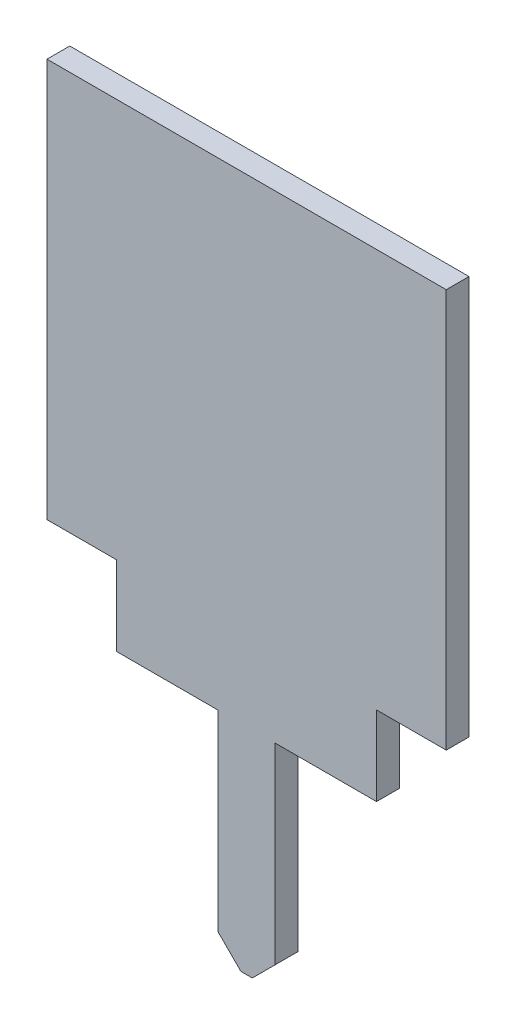
ISO-10303-21;
HEADER;
FILE_DESCRIPTION(('STEP AP214'),'2;1');
FILE_NAME('part.step','',(''),(''),'','','');
FILE_SCHEMA(('AUTOMOTIVE_DESIGN { 1 0 10303 214 1 1 1 1 }'));
ENDSEC;
DATA;
#1=APPLICATION_CONTEXT('core data for automotive mechanical design processes');
#2=APPLICATION_PROTOCOL_DEFINITION('international standard','automotive_design',2000,#1);
#3=PRODUCT_CONTEXT('',#1,'mechanical');
#4=PRODUCT('Part','Part','',(#3));
#5=PRODUCT_RELATED_PRODUCT_CATEGORY('part','',(#4));
#6=PRODUCT_DEFINITION_FORMATION('','',#4);
#7=PRODUCT_DEFINITION_CONTEXT('part definition',#1,'design');
#8=PRODUCT_DEFINITION('design','',#6,#7);
#9=PRODUCT_DEFINITION_SHAPE('','',#8);
#10=(LENGTH_UNIT() NAMED_UNIT(*) SI_UNIT(.MILLI.,.METRE.));
#11=(NAMED_UNIT(*) PLANE_ANGLE_UNIT() SI_UNIT($,.RADIAN.));
#12=(NAMED_UNIT(*) SI_UNIT($,.STERADIAN.) SOLID_ANGLE_UNIT());
#13=UNCERTAINTY_MEASURE_WITH_UNIT(LENGTH_MEASURE(1.E-05),#10,'distance_accuracy_value','');
#14=(GEOMETRIC_REPRESENTATION_CONTEXT(3) GLOBAL_UNCERTAINTY_ASSIGNED_CONTEXT((#13)) GLOBAL_UNIT_ASSIGNED_CONTEXT((#10,
#11,#12)) REPRESENTATION_CONTEXT('',''));
#15=CARTESIAN_POINT('',(0.,0.,0.));
#16=DIRECTION('',(0.,0.,1.));
#17=DIRECTION('',(1.,0.,0.));
#18=AXIS2_PLACEMENT_3D('',#15,#16,#17);
#19=CARTESIAN_POINT('',(2.225,0.,0.127));
#20=DIRECTION('',(0.,-1.,0.));
#21=DIRECTION('',(0.,0.,-1.));
#22=AXIS2_PLACEMENT_3D('',#19,#20,#21);
#23=PLANE('',#22);
#24=DIRECTION('',(-1.,0.,0.));
#25=VECTOR('',#24,1.);
#26=CARTESIAN_POINT('',(2.225,0.,-0.127));
#27=LINE('',#26,#25);
#28=CARTESIAN_POINT('',(2.225,0.,-0.127));
#29=VERTEX_POINT('',#28);
#30=CARTESIAN_POINT('',(-2.225,0.,-0.127));
#31=VERTEX_POINT('',#30);
#32=EDGE_CURVE('E11',#29,#31,#27,.T.);
#33=ORIENTED_EDGE('',*,*,#32,.T.);
#34=DIRECTION('',(0.,0.,-1.));
#35=VECTOR('',#34,1.);
#36=CARTESIAN_POINT('',(-2.225,0.,0.127));
#37=LINE('',#36,#35);
#38=CARTESIAN_POINT('',(-2.225,0.,0.127));
#39=VERTEX_POINT('',#38);
#40=EDGE_CURVE('E25',#39,#31,#37,.T.);
#41=ORIENTED_EDGE('',*,*,#40,.F.);
#42=DIRECTION('',(-1.,0.,0.));
#43=VECTOR('',#42,1.);
#44=CARTESIAN_POINT('',(2.225,0.,0.127));
#45=LINE('',#44,#43);
#46=CARTESIAN_POINT('',(2.225,0.,0.127));
#47=VERTEX_POINT('',#46);
#48=EDGE_CURVE('E296',#47,#39,#45,.T.);
#49=ORIENTED_EDGE('',*,*,#48,.F.);
#50=DIRECTION('',(0.,0.,-1.));
#51=VECTOR('',#50,1.);
#52=CARTESIAN_POINT('',(2.225,0.,0.127));
#53=LINE('',#52,#51);
#54=EDGE_CURVE('E292',#47,#29,#53,.T.);
#55=ORIENTED_EDGE('',*,*,#54,.T.);
#56=EDGE_LOOP('',(#33,#41,#49,#55));
#57=FACE_BOUND('',#56,.T.);
#58=ADVANCED_FACE('F17',(#57),#23,.F.);
#59=CARTESIAN_POINT('',(2.225,-4.445,0.127));
#60=DIRECTION('',(-1.,0.,0.));
#61=DIRECTION('',(0.,0.,1.));
#62=AXIS2_PLACEMENT_3D('',#59,#60,#61);
#63=PLANE('',#62);
#64=DIRECTION('',(0.,1.,0.));
#65=VECTOR('',#64,1.);
#66=CARTESIAN_POINT('',(2.225,-4.445,-0.127));
#67=LINE('',#66,#65);
#68=CARTESIAN_POINT('',(2.225,-4.445,-0.127));
#69=VERTEX_POINT('',#68);
#70=EDGE_CURVE('E287',#69,#29,#67,.T.);
#71=ORIENTED_EDGE('',*,*,#70,.T.);
#72=ORIENTED_EDGE('',*,*,#54,.F.);
#73=DIRECTION('',(0.,1.,0.));
#74=VECTOR('',#73,1.);
#75=CARTESIAN_POINT('',(2.225,-4.445,0.127));
#76=LINE('',#75,#74);
#77=CARTESIAN_POINT('',(2.225,-4.445,0.127));
#78=VERTEX_POINT('',#77);
#79=EDGE_CURVE('E282',#78,#47,#76,.T.);
#80=ORIENTED_EDGE('',*,*,#79,.F.);
#81=DIRECTION('',(0.,0.,-1.));
#82=VECTOR('',#81,1.);
#83=CARTESIAN_POINT('',(2.225,-4.445,0.127));
#84=LINE('',#83,#82);
#85=EDGE_CURVE('E278',#78,#69,#84,.T.);
#86=ORIENTED_EDGE('',*,*,#85,.T.);
#87=EDGE_LOOP('',(#71,#72,#80,#86));
#88=FACE_BOUND('',#87,.T.);
#89=ADVANCED_FACE('F309',(#88),#63,.F.);
#90=CARTESIAN_POINT('',(1.448,-4.445,0.127));
#91=DIRECTION('',(0.,1.,0.));
#92=DIRECTION('',(0.,0.,1.));
#93=AXIS2_PLACEMENT_3D('',#90,#91,#92);
#94=PLANE('',#93);
#95=DIRECTION('',(1.,0.,0.));
#96=VECTOR('',#95,1.);
#97=CARTESIAN_POINT('',(1.448,-4.445,-0.127));
#98=LINE('',#97,#96);
#99=CARTESIAN_POINT('',(1.448,-4.445,-0.127));
#100=VERTEX_POINT('',#99);
#101=EDGE_CURVE('E273',#100,#69,#98,.T.);
#102=ORIENTED_EDGE('',*,*,#101,.T.);
#103=ORIENTED_EDGE('',*,*,#85,.F.);
#104=DIRECTION('',(1.,0.,0.));
#105=VECTOR('',#104,1.);
#106=CARTESIAN_POINT('',(1.448,-4.445,0.127));
#107=LINE('',#106,#105);
#108=CARTESIAN_POINT('',(1.448,-4.445,0.127));
#109=VERTEX_POINT('',#108);
#110=EDGE_CURVE('E268',#109,#78,#107,.T.);
#111=ORIENTED_EDGE('',*,*,#110,.F.);
#112=DIRECTION('',(0.,0.,-1.));
#113=VECTOR('',#112,1.);
#114=CARTESIAN_POINT('',(1.448,-4.445,0.127));
#115=LINE('',#114,#113);
#116=EDGE_CURVE('E264',#109,#100,#115,.T.);
#117=ORIENTED_EDGE('',*,*,#116,.T.);
#118=EDGE_LOOP('',(#102,#103,#111,#117));
#119=FACE_BOUND('',#118,.T.);
#120=ADVANCED_FACE('F316',(#119),#94,.F.);
#121=CARTESIAN_POINT('',(1.448,-5.33,0.127));
#122=DIRECTION('',(-1.,0.,0.));
#123=DIRECTION('',(0.,0.,1.));
#124=AXIS2_PLACEMENT_3D('',#121,#122,#123);
#125=PLANE('',#124);
#126=DIRECTION('',(0.,1.,0.));
#127=VECTOR('',#126,1.);
#128=CARTESIAN_POINT('',(1.448,-5.33,-0.127));
#129=LINE('',#128,#127);
#130=CARTESIAN_POINT('',(1.448,-5.33,-0.127));
#131=VERTEX_POINT('',#130);
#132=EDGE_CURVE('E259',#131,#100,#129,.T.);
#133=ORIENTED_EDGE('',*,*,#132,.T.);
#134=ORIENTED_EDGE('',*,*,#116,.F.);
#135=DIRECTION('',(0.,1.,0.));
#136=VECTOR('',#135,1.);
#137=CARTESIAN_POINT('',(1.448,-5.33,0.127));
#138=LINE('',#137,#136);
#139=CARTESIAN_POINT('',(1.448,-5.33,0.127));
#140=VERTEX_POINT('',#139);
#141=EDGE_CURVE('E254',#140,#109,#138,.T.);
#142=ORIENTED_EDGE('',*,*,#141,.F.);
#143=DIRECTION('',(0.,0.,-1.));
#144=VECTOR('',#143,1.);
#145=CARTESIAN_POINT('',(1.448,-5.33,0.127));
#146=LINE('',#145,#144);
#147=EDGE_CURVE('E250',#140,#131,#146,.T.);
#148=ORIENTED_EDGE('',*,*,#147,.T.);
#149=EDGE_LOOP('',(#133,#134,#142,#148));
#150=FACE_BOUND('',#149,.T.);
#151=ADVANCED_FACE('F319',(#150),#125,.F.);
#152=CARTESIAN_POINT('',(0.3175,-5.33,0.127));
#153=DIRECTION('',(0.,1.,0.));
#154=DIRECTION('',(0.,0.,1.));
#155=AXIS2_PLACEMENT_3D('',#152,#153,#154);
#156=PLANE('',#155);
#157=DIRECTION('',(1.,0.,0.));
#158=VECTOR('',#157,1.);
#159=CARTESIAN_POINT('',(0.3175,-5.33,-0.127));
#160=LINE('',#159,#158);
#161=CARTESIAN_POINT('',(0.3175,-5.33,-0.127));
#162=VERTEX_POINT('',#161);
#163=EDGE_CURVE('E245',#162,#131,#160,.T.);
#164=ORIENTED_EDGE('',*,*,#163,.T.);
#165=ORIENTED_EDGE('',*,*,#147,.F.);
#166=DIRECTION('',(1.,0.,0.));
#167=VECTOR('',#166,1.);
#168=CARTESIAN_POINT('',(0.3175,-5.33,0.127));
#169=LINE('',#168,#167);
#170=CARTESIAN_POINT('',(0.3175,-5.33,0.127));
#171=VERTEX_POINT('',#170);
#172=EDGE_CURVE('E240',#171,#140,#169,.T.);
#173=ORIENTED_EDGE('',*,*,#172,.F.);
#174=DIRECTION('',(0.,0.,-1.));
#175=VECTOR('',#174,1.);
#176=CARTESIAN_POINT('',(0.3175,-5.33,0.127));
#177=LINE('',#176,#175);
#178=EDGE_CURVE('E236',#171,#162,#177,.T.);
#179=ORIENTED_EDGE('',*,*,#178,.T.);
#180=EDGE_LOOP('',(#164,#165,#173,#179));
#181=FACE_BOUND('',#180,.T.);
#182=ADVANCED_FACE('F322',(#181),#156,.F.);
#183=CARTESIAN_POINT('',(0.3175,-7.471,0.127));
#184=DIRECTION('',(-1.,0.,0.));
#185=DIRECTION('',(0.,0.,1.));
#186=AXIS2_PLACEMENT_3D('',#183,#184,#185);
#187=PLANE('',#186);
#188=DIRECTION('',(0.,1.,0.));
#189=VECTOR('',#188,1.);
#190=CARTESIAN_POINT('',(0.3175,-7.471,-0.127));
#191=LINE('',#190,#189);
#192=CARTESIAN_POINT('',(0.3175,-7.471,-0.127));
#193=VERTEX_POINT('',#192);
#194=EDGE_CURVE('E231',#193,#162,#191,.T.);
#195=ORIENTED_EDGE('',*,*,#194,.T.);
#196=ORIENTED_EDGE('',*,*,#178,.F.);
#197=DIRECTION('',(0.,1.,0.));
#198=VECTOR('',#197,1.);
#199=CARTESIAN_POINT('',(0.3175,-7.471,0.127));
#200=LINE('',#199,#198);
#201=CARTESIAN_POINT('',(0.3175,-7.471,0.127));
#202=VERTEX_POINT('',#201);
#203=EDGE_CURVE('E226',#202,#171,#200,.T.);
#204=ORIENTED_EDGE('',*,*,#203,.F.);
#205=DIRECTION('',(0.,0.,-1.));
#206=VECTOR('',#205,1.);
#207=CARTESIAN_POINT('',(0.3175,-7.471,0.127));
#208=LINE('',#207,#206);
#209=EDGE_CURVE('E222',#202,#193,#208,.T.);
#210=ORIENTED_EDGE('',*,*,#209,.T.);
#211=EDGE_LOOP('',(#195,#196,#204,#210));
#212=FACE_BOUND('',#211,.T.);
#213=ADVANCED_FACE('F328',(#212),#187,.F.);
#214=CARTESIAN_POINT('',(0.0635,-7.725,0.127));
#215=DIRECTION('',(-0.707106781186547,0.707106781186548,0.));
#216=DIRECTION('',(-0.707106781186548,-0.707106781186547,0.));
#217=AXIS2_PLACEMENT_3D('',#214,#215,#216);
#218=PLANE('',#217);
#219=DIRECTION('',(0.707106781186548,0.707106781186547,0.));
#220=VECTOR('',#219,1.);
#221=CARTESIAN_POINT('',(0.0635,-7.725,-0.127));
#222=LINE('',#221,#220);
#223=CARTESIAN_POINT('',(0.0635,-7.725,-0.127));
#224=VERTEX_POINT('',#223);
#225=EDGE_CURVE('E217',#224,#193,#222,.T.);
#226=ORIENTED_EDGE('',*,*,#225,.T.);
#227=ORIENTED_EDGE('',*,*,#209,.F.);
#228=DIRECTION('',(0.707106781186548,0.707106781186547,0.));
#229=VECTOR('',#228,1.);
#230=CARTESIAN_POINT('',(0.0635,-7.725,0.127));
#231=LINE('',#230,#229);
#232=CARTESIAN_POINT('',(0.0635,-7.725,0.127));
#233=VERTEX_POINT('',#232);
#234=EDGE_CURVE('E212',#233,#202,#231,.T.);
#235=ORIENTED_EDGE('',*,*,#234,.F.);
#236=DIRECTION('',(0.,0.,-1.));
#237=VECTOR('',#236,1.);
#238=CARTESIAN_POINT('',(0.0635,-7.725,0.127));
#239=LINE('',#238,#237);
#240=EDGE_CURVE('E208',#233,#224,#239,.T.);
#241=ORIENTED_EDGE('',*,*,#240,.T.);
#242=EDGE_LOOP('',(#226,#227,#235,#241));
#243=FACE_BOUND('',#242,.T.);
#244=ADVANCED_FACE('F331',(#243),#218,.F.);
#245=CARTESIAN_POINT('',(-0.0635,-7.725,0.127));
#246=DIRECTION('',(0.,1.,0.));
#247=DIRECTION('',(0.,0.,1.));
#248=AXIS2_PLACEMENT_3D('',#245,#246,#247);
#249=PLANE('',#248);
#250=DIRECTION('',(1.,0.,0.));
#251=VECTOR('',#250,1.);
#252=CARTESIAN_POINT('',(-0.0635,-7.725,-0.127));
#253=LINE('',#252,#251);
#254=CARTESIAN_POINT('',(-0.0635,-7.725,-0.127));
#255=VERTEX_POINT('',#254);
#256=EDGE_CURVE('E203',#255,#224,#253,.T.);
#257=ORIENTED_EDGE('',*,*,#256,.T.);
#258=ORIENTED_EDGE('',*,*,#240,.F.);
#259=DIRECTION('',(1.,0.,0.));
#260=VECTOR('',#259,1.);
#261=CARTESIAN_POINT('',(-0.0635,-7.725,0.127));
#262=LINE('',#261,#260);
#263=CARTESIAN_POINT('',(-0.0635,-7.725,0.127));
#264=VERTEX_POINT('',#263);
#265=EDGE_CURVE('E198',#264,#233,#262,.T.);
#266=ORIENTED_EDGE('',*,*,#265,.F.);
#267=DIRECTION('',(0.,0.,-1.));
#268=VECTOR('',#267,1.);
#269=CARTESIAN_POINT('',(-0.0635,-7.725,0.127));
#270=LINE('',#269,#268);
#271=EDGE_CURVE('E194',#264,#255,#270,.T.);
#272=ORIENTED_EDGE('',*,*,#271,.T.);
#273=EDGE_LOOP('',(#257,#258,#266,#272));
#274=FACE_BOUND('',#273,.T.);
#275=ADVANCED_FACE('F334',(#274),#249,.F.);
#276=CARTESIAN_POINT('',(-0.3175,-7.471,0.127));
#277=DIRECTION('',(0.707106781186547,0.707106781186548,0.));
#278=DIRECTION('',(-0.707106781186548,0.707106781186547,0.));
#279=AXIS2_PLACEMENT_3D('',#276,#277,#278);
#280=PLANE('',#279);
#281=DIRECTION('',(0.707106781186548,-0.707106781186547,0.));
#282=VECTOR('',#281,1.);
#283=CARTESIAN_POINT('',(-0.3175,-7.471,-0.127));
#284=LINE('',#283,#282);
#285=CARTESIAN_POINT('',(-0.3175,-7.471,-0.127));
#286=VERTEX_POINT('',#285);
#287=EDGE_CURVE('E189',#286,#255,#284,.T.);
#288=ORIENTED_EDGE('',*,*,#287,.T.);
#289=ORIENTED_EDGE('',*,*,#271,.F.);
#290=DIRECTION('',(0.707106781186548,-0.707106781186547,0.));
#291=VECTOR('',#290,1.);
#292=CARTESIAN_POINT('',(-0.3175,-7.471,0.127));
#293=LINE('',#292,#291);
#294=CARTESIAN_POINT('',(-0.3175,-7.471,0.127));
#295=VERTEX_POINT('',#294);
#296=EDGE_CURVE('E184',#295,#264,#293,.T.);
#297=ORIENTED_EDGE('',*,*,#296,.F.);
#298=DIRECTION('',(0.,0.,-1.));
#299=VECTOR('',#298,1.);
#300=CARTESIAN_POINT('',(-0.3175,-7.471,0.127));
#301=LINE('',#300,#299);
#302=EDGE_CURVE('E180',#295,#286,#301,.T.);
#303=ORIENTED_EDGE('',*,*,#302,.T.);
#304=EDGE_LOOP('',(#288,#289,#297,#303));
#305=FACE_BOUND('',#304,.T.);
#306=ADVANCED_FACE('F339',(#305),#280,.F.);
#307=CARTESIAN_POINT('',(-0.3175,-5.33,0.127));
#308=DIRECTION('',(1.,0.,0.));
#309=DIRECTION('',(0.,0.,-1.));
#310=AXIS2_PLACEMENT_3D('',#307,#308,#309);
#311=PLANE('',#310);
#312=DIRECTION('',(0.,-1.,0.));
#313=VECTOR('',#312,1.);
#314=CARTESIAN_POINT('',(-0.3175,-5.33,-0.127));
#315=LINE('',#314,#313);
#316=CARTESIAN_POINT('',(-0.3175,-5.33,-0.127));
#317=VERTEX_POINT('',#316);
#318=EDGE_CURVE('E175',#317,#286,#315,.T.);
#319=ORIENTED_EDGE('',*,*,#318,.T.);
#320=ORIENTED_EDGE('',*,*,#302,.F.);
#321=DIRECTION('',(0.,-1.,0.));
#322=VECTOR('',#321,1.);
#323=CARTESIAN_POINT('',(-0.3175,-5.33,0.127));
#324=LINE('',#323,#322);
#325=CARTESIAN_POINT('',(-0.3175,-5.33,0.127));
#326=VERTEX_POINT('',#325);
#327=EDGE_CURVE('E170',#326,#295,#324,.T.);
#328=ORIENTED_EDGE('',*,*,#327,.F.);
#329=DIRECTION('',(0.,0.,-1.));
#330=VECTOR('',#329,1.);
#331=CARTESIAN_POINT('',(-0.3175,-5.33,0.127));
#332=LINE('',#331,#330);
#333=EDGE_CURVE('E166',#326,#317,#332,.T.);
#334=ORIENTED_EDGE('',*,*,#333,.T.);
#335=EDGE_LOOP('',(#319,#320,#328,#334));
#336=FACE_BOUND('',#335,.T.);
#337=ADVANCED_FACE('F342',(#336),#311,.F.);
#338=CARTESIAN_POINT('',(-1.448,-5.33,0.127));
#339=DIRECTION('',(0.,1.,0.));
#340=DIRECTION('',(0.,0.,1.));
#341=AXIS2_PLACEMENT_3D('',#338,#339,#340);
#342=PLANE('',#341);
#343=DIRECTION('',(1.,0.,0.));
#344=VECTOR('',#343,1.);
#345=CARTESIAN_POINT('',(-1.448,-5.33,-0.127));
#346=LINE('',#345,#344);
#347=CARTESIAN_POINT('',(-1.448,-5.33,-0.127));
#348=VERTEX_POINT('',#347);
#349=EDGE_CURVE('E161',#348,#317,#346,.T.);
#350=ORIENTED_EDGE('',*,*,#349,.T.);
#351=ORIENTED_EDGE('',*,*,#333,.F.);
#352=DIRECTION('',(1.,0.,0.));
#353=VECTOR('',#352,1.);
#354=CARTESIAN_POINT('',(-1.448,-5.33,0.127));
#355=LINE('',#354,#353);
#356=CARTESIAN_POINT('',(-1.448,-5.33,0.127));
#357=VERTEX_POINT('',#356);
#358=EDGE_CURVE('E156',#357,#326,#355,.T.);
#359=ORIENTED_EDGE('',*,*,#358,.F.);
#360=DIRECTION('',(0.,0.,-1.));
#361=VECTOR('',#360,1.);
#362=CARTESIAN_POINT('',(-1.448,-5.33,0.127));
#363=LINE('',#362,#361);
#364=EDGE_CURVE('E152',#357,#348,#363,.T.);
#365=ORIENTED_EDGE('',*,*,#364,.T.);
#366=EDGE_LOOP('',(#350,#351,#359,#365));
#367=FACE_BOUND('',#366,.T.);
#368=ADVANCED_FACE('F345',(#367),#342,.F.);
#369=CARTESIAN_POINT('',(-1.448,-4.445,0.127));
#370=DIRECTION('',(1.,0.,0.));
#371=DIRECTION('',(0.,0.,-1.));
#372=AXIS2_PLACEMENT_3D('',#369,#370,#371);
#373=PLANE('',#372);
#374=DIRECTION('',(0.,-1.,0.));
#375=VECTOR('',#374,1.);
#376=CARTESIAN_POINT('',(-1.448,-4.445,-0.127));
#377=LINE('',#376,#375);
#378=CARTESIAN_POINT('',(-1.448,-4.445,-0.127));
#379=VERTEX_POINT('',#378);
#380=EDGE_CURVE('E134',#379,#348,#377,.T.);
#381=ORIENTED_EDGE('',*,*,#380,.T.);
#382=ORIENTED_EDGE('',*,*,#364,.F.);
#383=DIRECTION('',(0.,-1.,0.));
#384=VECTOR('',#383,1.);
#385=CARTESIAN_POINT('',(-1.448,-4.445,0.127));
#386=LINE('',#385,#384);
#387=CARTESIAN_POINT('',(-1.448,-4.445,0.127));
#388=VERTEX_POINT('',#387);
#389=EDGE_CURVE('E137',#388,#357,#386,.T.);
#390=ORIENTED_EDGE('',*,*,#389,.F.);
#391=DIRECTION('',(0.,0.,-1.));
#392=VECTOR('',#391,1.);
#393=CARTESIAN_POINT('',(-1.448,-4.445,0.127));
#394=LINE('',#393,#392);
#395=EDGE_CURVE('E135',#388,#379,#394,.T.);
#396=ORIENTED_EDGE('',*,*,#395,.T.);
#397=EDGE_LOOP('',(#381,#382,#390,#396));
#398=FACE_BOUND('',#397,.T.);
#399=ADVANCED_FACE('F348',(#398),#373,.F.);
#400=CARTESIAN_POINT('',(-2.225,-4.445,0.127));
#401=DIRECTION('',(0.,1.,0.));
#402=DIRECTION('',(0.,0.,1.));
#403=AXIS2_PLACEMENT_3D('',#400,#401,#402);
#404=PLANE('',#403);
#405=DIRECTION('',(1.,0.,0.));
#406=VECTOR('',#405,1.);
#407=CARTESIAN_POINT('',(-2.225,-4.445,-0.127));
#408=LINE('',#407,#406);
#409=CARTESIAN_POINT('',(-2.225,-4.445,-0.127));
#410=VERTEX_POINT('',#409);
#411=EDGE_CURVE('E118',#410,#379,#408,.T.);
#412=ORIENTED_EDGE('',*,*,#411,.T.);
#413=ORIENTED_EDGE('',*,*,#395,.F.);
#414=DIRECTION('',(1.,0.,0.));
#415=VECTOR('',#414,1.);
#416=CARTESIAN_POINT('',(-2.225,-4.445,0.127));
#417=LINE('',#416,#415);
#418=CARTESIAN_POINT('',(-2.225,-4.445,0.127));
#419=VERTEX_POINT('',#418);
#420=EDGE_CURVE('E121',#419,#388,#417,.T.);
#421=ORIENTED_EDGE('',*,*,#420,.F.);
#422=DIRECTION('',(0.,0.,-1.));
#423=VECTOR('',#422,1.);
#424=CARTESIAN_POINT('',(-2.225,-4.445,0.127));
#425=LINE('',#424,#423);
#426=EDGE_CURVE('E113',#419,#410,#425,.T.);
#427=ORIENTED_EDGE('',*,*,#426,.T.);
#428=EDGE_LOOP('',(#412,#413,#421,#427));
#429=FACE_BOUND('',#428,.T.);
#430=ADVANCED_FACE('F115',(#429),#404,.F.);
#431=CARTESIAN_POINT('',(-2.225,0.,0.127));
#432=DIRECTION('',(1.,0.,0.));
#433=DIRECTION('',(0.,0.,-1.));
#434=AXIS2_PLACEMENT_3D('',#431,#432,#433);
#435=PLANE('',#434);
#436=DIRECTION('',(0.,-1.,0.));
#437=VECTOR('',#436,1.);
#438=CARTESIAN_POINT('',(-2.225,0.,-0.127));
#439=LINE('',#438,#437);
#440=EDGE_CURVE('E124',#31,#410,#439,.T.);
#441=ORIENTED_EDGE('',*,*,#440,.T.);
#442=ORIENTED_EDGE('',*,*,#426,.F.);
#443=DIRECTION('',(0.,-1.,0.));
#444=VECTOR('',#443,1.);
#445=CARTESIAN_POINT('',(-2.225,0.,0.127));
#446=LINE('',#445,#444);
#447=EDGE_CURVE('E129',#39,#419,#446,.T.);
#448=ORIENTED_EDGE('',*,*,#447,.F.);
#449=ORIENTED_EDGE('',*,*,#40,.T.);
#450=EDGE_LOOP('',(#441,#442,#448,#449));
#451=FACE_BOUND('',#450,.T.);
#452=ADVANCED_FACE('F127',(#451),#435,.F.);
#453=CARTESIAN_POINT('',(0.,0.,0.127));
#454=DIRECTION('',(0.,0.,1.));
#455=DIRECTION('',(1.,0.,0.));
#456=AXIS2_PLACEMENT_3D('',#453,#454,#455);
#457=PLANE('',#456);
#458=ORIENTED_EDGE('',*,*,#447,.T.);
#459=ORIENTED_EDGE('',*,*,#420,.T.);
#460=ORIENTED_EDGE('',*,*,#389,.T.);
#461=ORIENTED_EDGE('',*,*,#358,.T.);
#462=ORIENTED_EDGE('',*,*,#327,.T.);
#463=ORIENTED_EDGE('',*,*,#296,.T.);
#464=ORIENTED_EDGE('',*,*,#265,.T.);
#465=ORIENTED_EDGE('',*,*,#234,.T.);
#466=ORIENTED_EDGE('',*,*,#203,.T.);
#467=ORIENTED_EDGE('',*,*,#172,.T.);
#468=ORIENTED_EDGE('',*,*,#141,.T.);
#469=ORIENTED_EDGE('',*,*,#110,.T.);
#470=ORIENTED_EDGE('',*,*,#79,.T.);
#471=ORIENTED_EDGE('',*,*,#48,.T.);
#472=EDGE_LOOP('',(#458,#459,#460,#461,#462,#463,#464,#465,#466,#467,#468,#469,#470,#471));
#473=FACE_BOUND('',#472,.T.);
#474=ADVANCED_FACE('F306',(#473),#457,.T.);
#475=CARTESIAN_POINT('',(0.,0.,-0.127));
#476=DIRECTION('',(0.,0.,1.));
#477=DIRECTION('',(1.,0.,0.));
#478=AXIS2_PLACEMENT_3D('',#475,#476,#477);
#479=PLANE('',#478);
#480=ORIENTED_EDGE('',*,*,#440,.F.);
#481=ORIENTED_EDGE('',*,*,#32,.F.);
#482=ORIENTED_EDGE('',*,*,#70,.F.);
#483=ORIENTED_EDGE('',*,*,#101,.F.);
#484=ORIENTED_EDGE('',*,*,#132,.F.);
#485=ORIENTED_EDGE('',*,*,#163,.F.);
#486=ORIENTED_EDGE('',*,*,#194,.F.);
#487=ORIENTED_EDGE('',*,*,#225,.F.);
#488=ORIENTED_EDGE('',*,*,#256,.F.);
#489=ORIENTED_EDGE('',*,*,#287,.F.);
#490=ORIENTED_EDGE('',*,*,#318,.F.);
#491=ORIENTED_EDGE('',*,*,#349,.F.);
#492=ORIENTED_EDGE('',*,*,#380,.F.);
#493=ORIENTED_EDGE('',*,*,#411,.F.);
#494=EDGE_LOOP('',(#480,#481,#482,#483,#484,#485,#486,#487,#488,#489,#490,#491,#492,#493));
#495=FACE_BOUND('',#494,.T.);
#496=ADVANCED_FACE('F131',(#495),#479,.F.);
#497=CLOSED_SHELL('',(#58,#89,#120,#151,#182,#213,#244,#275,#306,#337,#368,#399,#430,#452,#474,#496));
#498=MANIFOLD_SOLID_BREP('B1',#497);
#499=ADVANCED_BREP_SHAPE_REPRESENTATION('',(#18,#498),#14);
#500=SHAPE_DEFINITION_REPRESENTATION(#9,#499);
ENDSEC;
END-ISO-10303-21;
